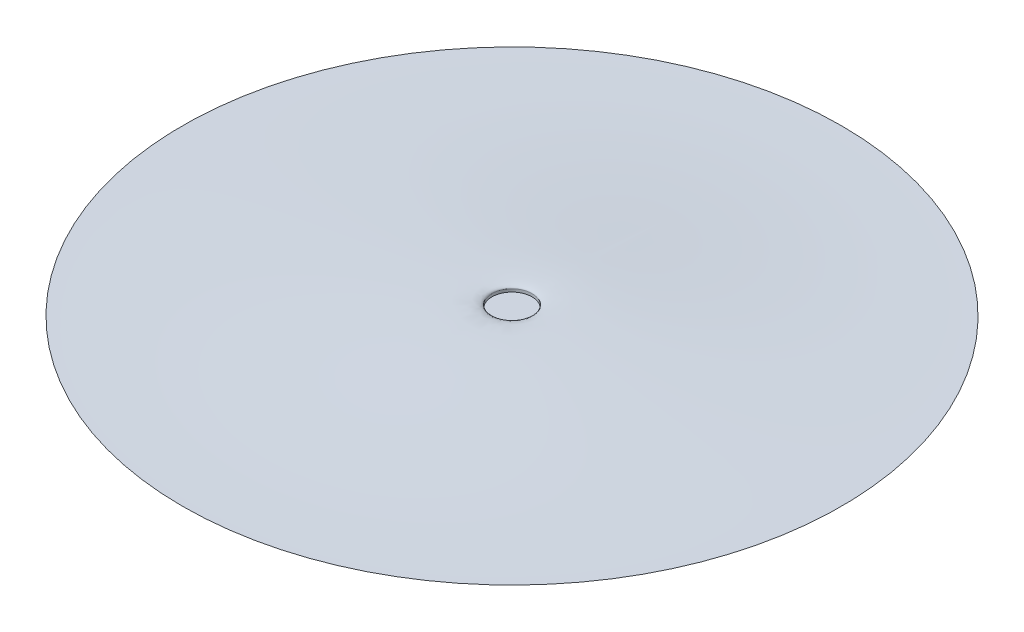
ISO-10303-21;
HEADER;
FILE_DESCRIPTION(('STEP AP214'),'2;1');
FILE_NAME('part.step','',(''),(''),'','','');
FILE_SCHEMA(('AUTOMOTIVE_DESIGN { 1 0 10303 214 1 1 1 1 }'));
ENDSEC;
DATA;
#1=APPLICATION_CONTEXT('core data for automotive mechanical design processes');
#2=APPLICATION_PROTOCOL_DEFINITION('international standard','automotive_design',2000,#1);
#3=PRODUCT_CONTEXT('',#1,'mechanical');
#4=PRODUCT('Part','Part','',(#3));
#5=PRODUCT_RELATED_PRODUCT_CATEGORY('part','',(#4));
#6=PRODUCT_DEFINITION_FORMATION('','',#4);
#7=PRODUCT_DEFINITION_CONTEXT('part definition',#1,'design');
#8=PRODUCT_DEFINITION('design','',#6,#7);
#9=PRODUCT_DEFINITION_SHAPE('','',#8);
#10=(LENGTH_UNIT() NAMED_UNIT(*) SI_UNIT(.MILLI.,.METRE.));
#11=(NAMED_UNIT(*) PLANE_ANGLE_UNIT() SI_UNIT($,.RADIAN.));
#12=(NAMED_UNIT(*) SI_UNIT($,.STERADIAN.) SOLID_ANGLE_UNIT());
#13=UNCERTAINTY_MEASURE_WITH_UNIT(LENGTH_MEASURE(1.E-05),#10,'distance_accuracy_value','');
#14=(GEOMETRIC_REPRESENTATION_CONTEXT(3) GLOBAL_UNCERTAINTY_ASSIGNED_CONTEXT((#13)) GLOBAL_UNIT_ASSIGNED_CONTEXT((#10,
#11,#12)) REPRESENTATION_CONTEXT('',''));
#15=CARTESIAN_POINT('',(0.,0.,0.));
#16=DIRECTION('',(0.,0.,1.));
#17=DIRECTION('',(1.,0.,0.));
#18=AXIS2_PLACEMENT_3D('',#15,#16,#17);
#19=CARTESIAN_POINT('',(0.,-4.73972349056372,-7.70283719616316));
#20=CARTESIAN_POINT('',(0.,-10.0706217580004,-7.70283719616316));
#21=CARTESIAN_POINT('',(0.,0.,-63.5));
#22=CARTESIAN_POINT('',(0.,0.,-127.));
#23=B_SPLINE_CURVE_WITH_KNOTS('',3,(#19,#20,#21,#22),.UNSPECIFIED.,.F.,.F.,(4,4),(0.,1.),.UNSPECIFIED.);
#24=CARTESIAN_POINT('',(0.,-2.54366189353751,0.));
#25=DIRECTION('',(0.,-1.,0.));
#26=AXIS1_PLACEMENT('',#24,#25);
#27=SURFACE_OF_REVOLUTION('',#23,#26);
#28=CARTESIAN_POINT('',(0.,0.,0.));
#29=DIRECTION('',(0.,-1.,0.));
#30=DIRECTION('',(0.,0.,-1.));
#31=AXIS2_PLACEMENT_3D('',#28,#29,#30);
#32=CIRCLE('',#31,127.);
#33=CARTESIAN_POINT('',(0.,0.,-127.));
#34=VERTEX_POINT('',#33);
#35=EDGE_CURVE('E56',#34,#34,#32,.T.);
#36=ORIENTED_EDGE('',*,*,#35,.T.);
#37=EDGE_LOOP('',(#36));
#38=FACE_BOUND('',#37,.T.);
#39=CARTESIAN_POINT('',(0.,-4.73972349056372,0.));
#40=DIRECTION('',(0.,-1.,0.));
#41=DIRECTION('',(0.,0.,-1.));
#42=AXIS2_PLACEMENT_3D('',#39,#40,#41);
#43=CIRCLE('',#42,7.70283719616316);
#44=CARTESIAN_POINT('',(0.,-4.73972349056372,-7.70283719616316));
#45=VERTEX_POINT('',#44);
#46=EDGE_CURVE('E10',#45,#45,#43,.T.);
#47=ORIENTED_EDGE('',*,*,#46,.F.);
#48=EDGE_LOOP('',(#47));
#49=FACE_BOUND('',#48,.T.);
#50=ADVANCED_FACE('F36',(#38,#49),#27,.F.);
#51=CARTESIAN_POINT('',(0.,-2.54366189353751,0.));
#52=DIRECTION('',(0.,-1.,0.));
#53=DIRECTION('',(0.,0.,-1.));
#54=AXIS2_PLACEMENT_3D('',#51,#52,#53);
#55=CYLINDRICAL_SURFACE('',#54,7.70283719616316);
#56=ORIENTED_EDGE('',*,*,#46,.T.);
#57=EDGE_LOOP('',(#56));
#58=FACE_BOUND('',#57,.T.);
#59=CARTESIAN_POINT('',(0.,-2.54366189353751,0.));
#60=DIRECTION('',(0.,-1.,0.));
#61=DIRECTION('',(0.,0.,-1.));
#62=AXIS2_PLACEMENT_3D('',#59,#60,#61);
#63=CIRCLE('',#62,7.70283719616316);
#64=CARTESIAN_POINT('',(0.,-2.54366189353751,-7.70283719616316));
#65=VERTEX_POINT('',#64);
#66=EDGE_CURVE('E43',#65,#65,#63,.T.);
#67=ORIENTED_EDGE('',*,*,#66,.F.);
#68=EDGE_LOOP('',(#67));
#69=FACE_BOUND('',#68,.T.);
#70=ADVANCED_FACE('F83',(#58,#69),#55,.F.);
#71=CARTESIAN_POINT('',(0.,-2.54366189353751,0.));
#72=DIRECTION('',(0.,-1.,0.));
#73=DIRECTION('',(0.,0.,-1.));
#74=AXIS2_PLACEMENT_3D('',#71,#72,#73);
#75=PLANE('',#74);
#76=ORIENTED_EDGE('',*,*,#66,.T.);
#77=EDGE_LOOP('',(#76));
#78=FACE_BOUND('',#77,.T.);
#79=ADVANCED_FACE('F80',(#78),#75,.T.);
#80=CARTESIAN_POINT('',(0.,2.54366189353751,0.));
#81=DIRECTION('',(0.,1.,0.));
#82=DIRECTION('',(0.,0.,1.));
#83=AXIS2_PLACEMENT_3D('',#80,#81,#82);
#84=PLANE('',#83);
#85=CARTESIAN_POINT('',(0.,2.54366189353751,0.));
#86=DIRECTION('',(0.,-1.,0.));
#87=DIRECTION('',(0.,0.,-1.));
#88=AXIS2_PLACEMENT_3D('',#85,#86,#87);
#89=CIRCLE('',#88,7.70283719616316);
#90=CARTESIAN_POINT('',(0.,2.54366189353751,-7.70283719616316));
#91=VERTEX_POINT('',#90);
#92=EDGE_CURVE('E47',#91,#91,#89,.T.);
#93=ORIENTED_EDGE('',*,*,#92,.F.);
#94=EDGE_LOOP('',(#93));
#95=FACE_BOUND('',#94,.T.);
#96=ADVANCED_FACE('F76',(#95),#84,.T.);
#97=CARTESIAN_POINT('',(0.,-2.54366189353751,0.));
#98=DIRECTION('',(0.,-1.,0.));
#99=DIRECTION('',(0.,0.,-1.));
#100=AXIS2_PLACEMENT_3D('',#97,#98,#99);
#101=CYLINDRICAL_SURFACE('',#100,7.70283719616316);
#102=ORIENTED_EDGE('',*,*,#92,.T.);
#103=EDGE_LOOP('',(#102));
#104=FACE_BOUND('',#103,.T.);
#105=CARTESIAN_POINT('',(0.,3.62702523840319,0.));
#106=DIRECTION('',(0.,-1.,0.));
#107=DIRECTION('',(0.,0.,-1.));
#108=AXIS2_PLACEMENT_3D('',#105,#106,#107);
#109=CIRCLE('',#108,7.70283719616316);
#110=CARTESIAN_POINT('',(0.,3.62702523840319,-7.70283719616316));
#111=VERTEX_POINT('',#110);
#112=EDGE_CURVE('E51',#111,#111,#109,.T.);
#113=ORIENTED_EDGE('',*,*,#112,.F.);
#114=EDGE_LOOP('',(#113));
#115=FACE_BOUND('',#114,.T.);
#116=ADVANCED_FACE('F72',(#104,#115),#101,.F.);
#117=CARTESIAN_POINT('',(0.,0.,-127.));
#118=CARTESIAN_POINT('',(0.,0.,-63.5));
#119=CARTESIAN_POINT('',(0.,8.15926534020406,-7.70283719616316));
#120=CARTESIAN_POINT('',(0.,3.62702523840319,-7.70283719616316));
#121=B_SPLINE_CURVE_WITH_KNOTS('',3,(#117,#118,#119,#120),.UNSPECIFIED.,.F.,.F.,(4,4),(0.,1.),.UNSPECIFIED.);
#122=CARTESIAN_POINT('',(0.,-2.54366189353751,0.));
#123=DIRECTION('',(0.,-1.,0.));
#124=AXIS1_PLACEMENT('',#122,#123);
#125=SURFACE_OF_REVOLUTION('',#121,#124);
#126=ORIENTED_EDGE('',*,*,#112,.T.);
#127=EDGE_LOOP('',(#126));
#128=FACE_BOUND('',#127,.T.);
#129=ORIENTED_EDGE('',*,*,#35,.F.);
#130=EDGE_LOOP('',(#129));
#131=FACE_BOUND('',#130,.T.);
#132=ADVANCED_FACE('F69',(#128,#131),#125,.F.);
#133=CLOSED_SHELL('',(#50,#70,#79,#96,#116,#132));
#134=MANIFOLD_SOLID_BREP('B2',#133);
#135=ADVANCED_BREP_SHAPE_REPRESENTATION('',(#18,#134),#14);
#136=SHAPE_DEFINITION_REPRESENTATION(#9,#135);
ENDSEC;
END-ISO-10303-21;
